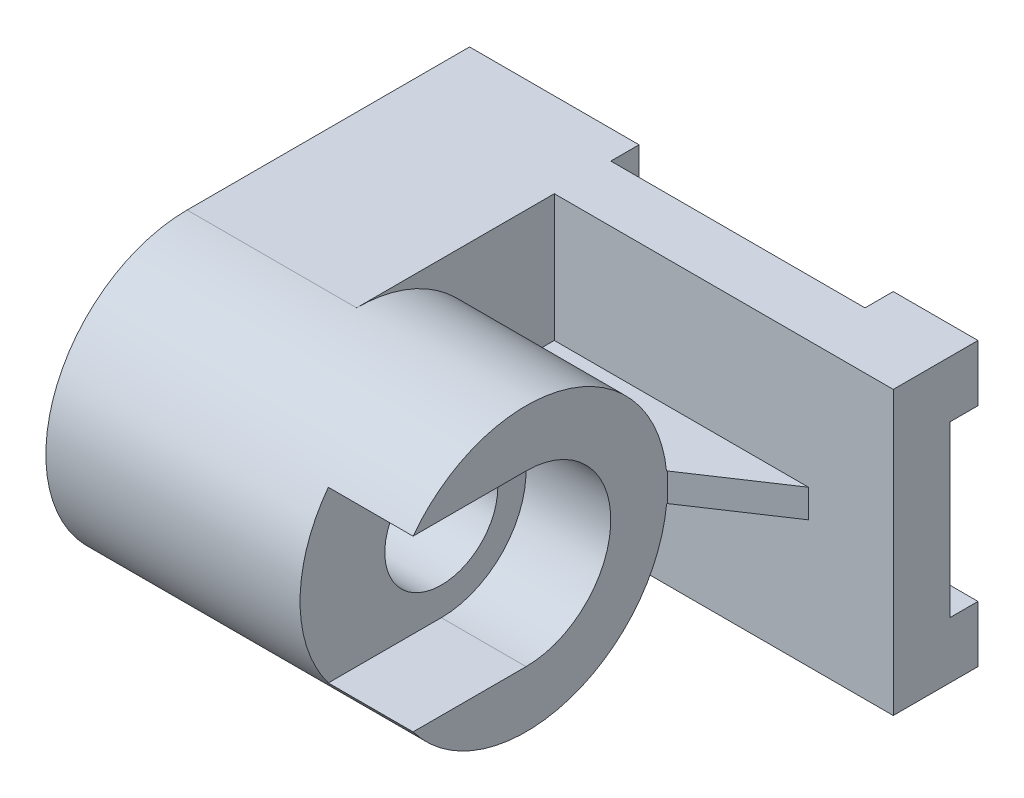
ISO-10303-21;
HEADER;
FILE_DESCRIPTION(('STEP AP214'),'2;1');
FILE_NAME('part.step','',(''),(''),'','','');
FILE_SCHEMA(('AUTOMOTIVE_DESIGN { 1 0 10303 214 1 1 1 1 }'));
ENDSEC;
DATA;
#1=APPLICATION_CONTEXT('core data for automotive mechanical design processes');
#2=APPLICATION_PROTOCOL_DEFINITION('international standard','automotive_design',2000,#1);
#3=PRODUCT_CONTEXT('',#1,'mechanical');
#4=PRODUCT('Part','Part','',(#3));
#5=PRODUCT_RELATED_PRODUCT_CATEGORY('part','',(#4));
#6=PRODUCT_DEFINITION_FORMATION('','',#4);
#7=PRODUCT_DEFINITION_CONTEXT('part definition',#1,'design');
#8=PRODUCT_DEFINITION('design','',#6,#7);
#9=PRODUCT_DEFINITION_SHAPE('','',#8);
#10=(LENGTH_UNIT() NAMED_UNIT(*) SI_UNIT(.MILLI.,.METRE.));
#11=(NAMED_UNIT(*) PLANE_ANGLE_UNIT() SI_UNIT($,.RADIAN.));
#12=(NAMED_UNIT(*) SI_UNIT($,.STERADIAN.) SOLID_ANGLE_UNIT());
#13=UNCERTAINTY_MEASURE_WITH_UNIT(LENGTH_MEASURE(1.E-05),#10,'distance_accuracy_value','');
#14=(GEOMETRIC_REPRESENTATION_CONTEXT(3) GLOBAL_UNCERTAINTY_ASSIGNED_CONTEXT((#13)) GLOBAL_UNIT_ASSIGNED_CONTEXT((#10,
#11,#12)) REPRESENTATION_CONTEXT('',''));
#15=CARTESIAN_POINT('',(0.,0.,0.));
#16=DIRECTION('',(0.,0.,1.));
#17=DIRECTION('',(1.,0.,0.));
#18=AXIS2_PLACEMENT_3D('',#15,#16,#17);
#19=CARTESIAN_POINT('',(18.,-5.,0.));
#20=DIRECTION('',(0.,-1.,0.));
#21=DIRECTION('',(0.,0.,-1.));
#22=AXIS2_PLACEMENT_3D('',#19,#20,#21);
#23=PLANE('',#22);
#24=DIRECTION('',(1.,0.,0.));
#25=VECTOR('',#24,1.);
#26=CARTESIAN_POINT('',(15.,-5.,-2.));
#27=LINE('',#26,#25);
#28=CARTESIAN_POINT('',(6.,-5.,-2.00000000000001));
#29=VERTEX_POINT('',#28);
#30=CARTESIAN_POINT('',(18.,-5.,-2.));
#31=VERTEX_POINT('',#30);
#32=EDGE_CURVE('E290',#29,#31,#27,.T.);
#33=ORIENTED_EDGE('',*,*,#32,.F.);
#34=DIRECTION('',(0.,0.,-1.));
#35=VECTOR('',#34,1.);
#36=CARTESIAN_POINT('',(6.,-5.,0.));
#37=LINE('',#36,#35);
#38=CARTESIAN_POINT('',(5.99999999999999,-5.,4.99999999999999));
#39=VERTEX_POINT('',#38);
#40=EDGE_CURVE('E249',#39,#29,#37,.T.);
#41=ORIENTED_EDGE('',*,*,#40,.F.);
#42=DIRECTION('',(-1.,0.,0.));
#43=VECTOR('',#42,1.);
#44=CARTESIAN_POINT('',(18.,-5.,5.));
#45=LINE('',#44,#43);
#46=CARTESIAN_POINT('',(0.,-5.,5.));
#47=VERTEX_POINT('',#46);
#48=EDGE_CURVE('E390',#39,#47,#45,.T.);
#49=ORIENTED_EDGE('',*,*,#48,.T.);
#50=DIRECTION('',(0.,0.,1.));
#51=VECTOR('',#50,1.);
#52=CARTESIAN_POINT('',(0.,-5.,0.));
#53=LINE('',#52,#51);
#54=CARTESIAN_POINT('',(0.,-5.,-5.));
#55=VERTEX_POINT('',#54);
#56=EDGE_CURVE('E348',#55,#47,#53,.T.);
#57=ORIENTED_EDGE('',*,*,#56,.F.);
#58=DIRECTION('',(-1.,0.,0.));
#59=VECTOR('',#58,1.);
#60=CARTESIAN_POINT('',(18.,-5.,-5.));
#61=LINE('',#60,#59);
#62=CARTESIAN_POINT('',(6.,-5.,-5.));
#63=VERTEX_POINT('',#62);
#64=EDGE_CURVE('E386',#63,#55,#61,.T.);
#65=ORIENTED_EDGE('',*,*,#64,.F.);
#66=DIRECTION('',(0.,0.,-1.));
#67=VECTOR('',#66,1.);
#68=CARTESIAN_POINT('',(6.,-5.,-5.));
#69=LINE('',#68,#67);
#70=CARTESIAN_POINT('',(6.,-5.,-4.));
#71=VERTEX_POINT('',#70);
#72=EDGE_CURVE('E301',#71,#63,#69,.T.);
#73=ORIENTED_EDGE('',*,*,#72,.F.);
#74=DIRECTION('',(-1.,0.,0.));
#75=VECTOR('',#74,1.);
#76=CARTESIAN_POINT('',(15.,-5.,-4.));
#77=LINE('',#76,#75);
#78=CARTESIAN_POINT('',(15.,-5.,-4.));
#79=VERTEX_POINT('',#78);
#80=EDGE_CURVE('E299',#79,#71,#77,.T.);
#81=ORIENTED_EDGE('',*,*,#80,.F.);
#82=DIRECTION('',(0.,0.,1.));
#83=VECTOR('',#82,1.);
#84=CARTESIAN_POINT('',(15.,-5.,-5.));
#85=LINE('',#84,#83);
#86=CARTESIAN_POINT('',(15.,-5.,-5.));
#87=VERTEX_POINT('',#86);
#88=EDGE_CURVE('E288',#87,#79,#85,.T.);
#89=ORIENTED_EDGE('',*,*,#88,.F.);
#90=CARTESIAN_POINT('',(18.,-5.,-5.));
#91=VERTEX_POINT('',#90);
#92=EDGE_CURVE('E387',#91,#87,#61,.T.);
#93=ORIENTED_EDGE('',*,*,#92,.F.);
#94=DIRECTION('',(0.,0.,1.));
#95=VECTOR('',#94,1.);
#96=CARTESIAN_POINT('',(18.,-5.,0.));
#97=LINE('',#96,#95);
#98=EDGE_CURVE('E326',#91,#31,#97,.T.);
#99=ORIENTED_EDGE('',*,*,#98,.T.);
#100=EDGE_LOOP('',(#33,#41,#49,#57,#65,#73,#81,#89,#93,#99));
#101=FACE_BOUND('',#100,.T.);
#102=ADVANCED_FACE('F35',(#101),#23,.T.);
#103=CARTESIAN_POINT('',(12.,13.,0.));
#104=DIRECTION('',(-0.554700196225229,0.,-0.832050294337843));
#105=DIRECTION('',(-0.832050294337844,0.,0.554700196225229));
#106=AXIS2_PLACEMENT_3D('',#103,#104,#105);
#107=PLANE('',#106);
#108=DIRECTION('',(0.832050294337844,0.,-0.554700196225229));
#109=VECTOR('',#108,1.);
#110=CARTESIAN_POINT('',(12.,0.500000000000002,0.));
#111=LINE('',#110,#109);
#112=CARTESIAN_POINT('',(12.,0.500000000000002,0.));
#113=VERTEX_POINT('',#112);
#114=CARTESIAN_POINT('',(15.,0.500000000000002,-2.));
#115=VERTEX_POINT('',#114);
#116=EDGE_CURVE('E264',#113,#115,#111,.T.);
#117=ORIENTED_EDGE('',*,*,#116,.F.);
#118=DIRECTION('',(0.,-1.,0.));
#119=VECTOR('',#118,1.);
#120=CARTESIAN_POINT('',(12.,13.,0.));
#121=LINE('',#120,#119);
#122=CARTESIAN_POINT('',(12.,-0.499999999999998,0.));
#123=VERTEX_POINT('',#122);
#124=EDGE_CURVE('E292',#113,#123,#121,.T.);
#125=ORIENTED_EDGE('',*,*,#124,.T.);
#126=DIRECTION('',(-0.832050294337844,0.,0.554700196225229));
#127=VECTOR('',#126,1.);
#128=CARTESIAN_POINT('',(12.,-0.499999999999999,0.));
#129=LINE('',#128,#127);
#130=CARTESIAN_POINT('',(15.,-0.499999999999998,-2.));
#131=VERTEX_POINT('',#130);
#132=EDGE_CURVE('E262',#131,#123,#129,.T.);
#133=ORIENTED_EDGE('',*,*,#132,.F.);
#134=DIRECTION('',(0.,-1.,0.));
#135=VECTOR('',#134,1.);
#136=CARTESIAN_POINT('',(15.,13.,-2.));
#137=LINE('',#136,#135);
#138=EDGE_CURVE('E223',#115,#131,#137,.T.);
#139=ORIENTED_EDGE('',*,*,#138,.F.);
#140=EDGE_LOOP('',(#117,#125,#133,#139));
#141=FACE_BOUND('',#140,.T.);
#142=ADVANCED_FACE('F430',(#141),#107,.F.);
#143=CARTESIAN_POINT('',(12.,13.,9.00000000000001));
#144=DIRECTION('',(-1.,0.,0.));
#145=DIRECTION('',(0.,0.,1.));
#146=AXIS2_PLACEMENT_3D('',#143,#144,#145);
#147=PLANE('',#146);
#148=DIRECTION('',(0.,0.,-1.));
#149=VECTOR('',#148,1.);
#150=CARTESIAN_POINT('',(12.,0.5,9.));
#151=LINE('',#150,#149);
#152=CARTESIAN_POINT('',(12.,0.500000000000002,0.0250628144669021));
#153=VERTEX_POINT('',#152);
#154=EDGE_CURVE('E11',#153,#113,#151,.T.);
#155=ORIENTED_EDGE('',*,*,#154,.F.);
#156=CARTESIAN_POINT('',(12.,0.,5.));
#157=DIRECTION('',(-1.,0.,0.));
#158=DIRECTION('',(0.,0.,1.));
#159=AXIS2_PLACEMENT_3D('',#156,#157,#158);
#160=CIRCLE('',#159,5.);
#161=CARTESIAN_POINT('',(12.,3.,9.));
#162=VERTEX_POINT('',#161);
#163=EDGE_CURVE('E323',#162,#153,#160,.T.);
#164=ORIENTED_EDGE('',*,*,#163,.F.);
#165=DIRECTION('',(0.,0.,1.));
#166=VECTOR('',#165,1.);
#167=CARTESIAN_POINT('',(12.,3.,0.));
#168=LINE('',#167,#166);
#169=CARTESIAN_POINT('',(12.,3.,5.));
#170=VERTEX_POINT('',#169);
#171=EDGE_CURVE('E266',#170,#162,#168,.T.);
#172=ORIENTED_EDGE('',*,*,#171,.F.);
#173=CARTESIAN_POINT('',(12.,0.,5.));
#174=DIRECTION('',(1.,0.,0.));
#175=DIRECTION('',(0.,0.,-1.));
#176=AXIS2_PLACEMENT_3D('',#173,#174,#175);
#177=CIRCLE('',#176,3.);
#178=CARTESIAN_POINT('',(12.,-3.,5.));
#179=VERTEX_POINT('',#178);
#180=EDGE_CURVE('E271',#179,#170,#177,.T.);
#181=ORIENTED_EDGE('',*,*,#180,.F.);
#182=DIRECTION('',(0.,0.,1.));
#183=VECTOR('',#182,1.);
#184=CARTESIAN_POINT('',(12.,-3.,0.));
#185=LINE('',#184,#183);
#186=CARTESIAN_POINT('',(12.,-3.,9.));
#187=VERTEX_POINT('',#186);
#188=EDGE_CURVE('E281',#179,#187,#185,.T.);
#189=ORIENTED_EDGE('',*,*,#188,.T.);
#190=CARTESIAN_POINT('',(12.,-0.499999999999998,0.0250628144669021));
#191=VERTEX_POINT('',#190);
#192=EDGE_CURVE('E325',#191,#187,#160,.T.);
#193=ORIENTED_EDGE('',*,*,#192,.F.);
#194=DIRECTION('',(0.,0.,1.));
#195=VECTOR('',#194,1.);
#196=CARTESIAN_POINT('',(12.,-0.5,9.));
#197=LINE('',#196,#195);
#198=EDGE_CURVE('E43',#123,#191,#197,.T.);
#199=ORIENTED_EDGE('',*,*,#198,.F.);
#200=ORIENTED_EDGE('',*,*,#124,.F.);
#201=EDGE_LOOP('',(#155,#164,#172,#181,#189,#193,#199,#200));
#202=FACE_BOUND('',#201,.T.);
#203=ADVANCED_FACE('F432',(#202),#147,.F.);
#204=CARTESIAN_POINT('',(18.,0.,5.));
#205=DIRECTION('',(-1.,0.,0.));
#206=DIRECTION('',(0.,0.,1.));
#207=AXIS2_PLACEMENT_3D('',#204,#205,#206);
#208=CYLINDRICAL_SURFACE('',#207,2.);
#209=CARTESIAN_POINT('',(0.,0.,5.));
#210=DIRECTION('',(1.,0.,0.));
#211=DIRECTION('',(0.,0.,-1.));
#212=AXIS2_PLACEMENT_3D('',#209,#210,#211);
#213=CIRCLE('',#212,2.);
#214=CARTESIAN_POINT('',(0.,0.,3.));
#215=VERTEX_POINT('',#214);
#216=EDGE_CURVE('E342',#215,#215,#213,.T.);
#217=ORIENTED_EDGE('',*,*,#216,.F.);
#218=EDGE_LOOP('',(#217));
#219=FACE_BOUND('',#218,.T.);
#220=CARTESIAN_POINT('',(9.,0.,5.));
#221=DIRECTION('',(1.,0.,0.));
#222=DIRECTION('',(0.,0.,-1.));
#223=AXIS2_PLACEMENT_3D('',#220,#221,#222);
#224=CIRCLE('',#223,2.);
#225=CARTESIAN_POINT('',(9.,0.,3.));
#226=VERTEX_POINT('',#225);
#227=EDGE_CURVE('E276',#226,#226,#224,.F.);
#228=ORIENTED_EDGE('',*,*,#227,.F.);
#229=EDGE_LOOP('',(#228));
#230=FACE_BOUND('',#229,.T.);
#231=ADVANCED_FACE('F37',(#219,#230),#208,.F.);
#232=CARTESIAN_POINT('',(18.,0.,-5.));
#233=DIRECTION('',(0.,0.,1.));
#234=DIRECTION('',(1.,0.,0.));
#235=AXIS2_PLACEMENT_3D('',#232,#233,#234);
#236=PLANE('',#235);
#237=ORIENTED_EDGE('',*,*,#92,.T.);
#238=DIRECTION('',(0.,-1.,0.));
#239=VECTOR('',#238,1.);
#240=CARTESIAN_POINT('',(15.,13.,-5.));
#241=LINE('',#240,#239);
#242=CARTESIAN_POINT('',(15.,-3.,-5.));
#243=VERTEX_POINT('',#242);
#244=EDGE_CURVE('E304',#243,#87,#241,.T.);
#245=ORIENTED_EDGE('',*,*,#244,.F.);
#246=DIRECTION('',(-1.,0.,0.));
#247=VECTOR('',#246,1.);
#248=CARTESIAN_POINT('',(18.,-3.,-5.));
#249=LINE('',#248,#247);
#250=CARTESIAN_POINT('',(18.,-3.,-5.));
#251=VERTEX_POINT('',#250);
#252=EDGE_CURVE('E383',#251,#243,#249,.T.);
#253=ORIENTED_EDGE('',*,*,#252,.F.);
#254=DIRECTION('',(0.,1.,0.));
#255=VECTOR('',#254,1.);
#256=CARTESIAN_POINT('',(18.,0.,-5.));
#257=LINE('',#256,#255);
#258=EDGE_CURVE('E329',#91,#251,#257,.T.);
#259=ORIENTED_EDGE('',*,*,#258,.F.);
#260=EDGE_LOOP('',(#237,#245,#253,#259));
#261=FACE_BOUND('',#260,.T.);
#262=ADVANCED_FACE('F484',(#261),#236,.F.);
#263=CARTESIAN_POINT('',(18.,-3.,0.));
#264=DIRECTION('',(0.,-1.,0.));
#265=DIRECTION('',(0.,0.,-1.));
#266=AXIS2_PLACEMENT_3D('',#263,#264,#265);
#267=PLANE('',#266);
#268=ORIENTED_EDGE('',*,*,#252,.T.);
#269=DIRECTION('',(0.,0.,1.));
#270=VECTOR('',#269,1.);
#271=CARTESIAN_POINT('',(15.,-3.,0.));
#272=LINE('',#271,#270);
#273=CARTESIAN_POINT('',(15.,-3.,-4.));
#274=VERTEX_POINT('',#273);
#275=EDGE_CURVE('E320',#243,#274,#272,.T.);
#276=ORIENTED_EDGE('',*,*,#275,.T.);
#277=DIRECTION('',(-1.,0.,0.));
#278=VECTOR('',#277,1.);
#279=CARTESIAN_POINT('',(18.,-3.,-4.));
#280=LINE('',#279,#278);
#281=CARTESIAN_POINT('',(18.,-3.,-4.));
#282=VERTEX_POINT('',#281);
#283=EDGE_CURVE('E379',#282,#274,#280,.T.);
#284=ORIENTED_EDGE('',*,*,#283,.F.);
#285=DIRECTION('',(0.,0.,1.));
#286=VECTOR('',#285,1.);
#287=CARTESIAN_POINT('',(18.,-3.,0.));
#288=LINE('',#287,#286);
#289=EDGE_CURVE('E332',#251,#282,#288,.T.);
#290=ORIENTED_EDGE('',*,*,#289,.F.);
#291=EDGE_LOOP('',(#268,#276,#284,#290));
#292=FACE_BOUND('',#291,.T.);
#293=ADVANCED_FACE('F488',(#292),#267,.F.);
#294=CARTESIAN_POINT('',(18.,3.,0.));
#295=DIRECTION('',(0.,-1.,0.));
#296=DIRECTION('',(0.,0.,-1.));
#297=AXIS2_PLACEMENT_3D('',#294,#295,#296);
#298=PLANE('',#297);
#299=DIRECTION('',(0.,0.,1.));
#300=VECTOR('',#299,1.);
#301=CARTESIAN_POINT('',(15.,3.,0.));
#302=LINE('',#301,#300);
#303=CARTESIAN_POINT('',(15.,3.,-5.));
#304=VERTEX_POINT('',#303);
#305=CARTESIAN_POINT('',(15.,3.,-4.));
#306=VERTEX_POINT('',#305);
#307=EDGE_CURVE('E318',#304,#306,#302,.T.);
#308=ORIENTED_EDGE('',*,*,#307,.F.);
#309=DIRECTION('',(-1.,0.,0.));
#310=VECTOR('',#309,1.);
#311=CARTESIAN_POINT('',(18.,3.,-5.));
#312=LINE('',#311,#310);
#313=CARTESIAN_POINT('',(18.,3.,-5.));
#314=VERTEX_POINT('',#313);
#315=EDGE_CURVE('E371',#314,#304,#312,.T.);
#316=ORIENTED_EDGE('',*,*,#315,.F.);
#317=DIRECTION('',(0.,0.,1.));
#318=VECTOR('',#317,1.);
#319=CARTESIAN_POINT('',(18.,3.,0.));
#320=LINE('',#319,#318);
#321=CARTESIAN_POINT('',(18.,3.,-4.));
#322=VERTEX_POINT('',#321);
#323=EDGE_CURVE('E337',#314,#322,#320,.T.);
#324=ORIENTED_EDGE('',*,*,#323,.T.);
#325=DIRECTION('',(-1.,0.,0.));
#326=VECTOR('',#325,1.);
#327=CARTESIAN_POINT('',(18.,3.,-4.));
#328=LINE('',#327,#326);
#329=EDGE_CURVE('E375',#322,#306,#328,.T.);
#330=ORIENTED_EDGE('',*,*,#329,.T.);
#331=EDGE_LOOP('',(#308,#316,#324,#330));
#332=FACE_BOUND('',#331,.T.);
#333=ADVANCED_FACE('F482',(#332),#298,.T.);
#334=ORIENTED_EDGE('',*,*,#315,.T.);
#335=CARTESIAN_POINT('',(15.,5.,-5.));
#336=VERTEX_POINT('',#335);
#337=EDGE_CURVE('E293',#336,#304,#241,.T.);
#338=ORIENTED_EDGE('',*,*,#337,.F.);
#339=DIRECTION('',(-1.,0.,0.));
#340=VECTOR('',#339,1.);
#341=CARTESIAN_POINT('',(18.,5.,-5.));
#342=LINE('',#341,#340);
#343=CARTESIAN_POINT('',(18.,5.,-5.));
#344=VERTEX_POINT('',#343);
#345=EDGE_CURVE('E367',#344,#336,#342,.T.);
#346=ORIENTED_EDGE('',*,*,#345,.F.);
#347=EDGE_CURVE('E333',#314,#344,#257,.T.);
#348=ORIENTED_EDGE('',*,*,#347,.F.);
#349=EDGE_LOOP('',(#334,#338,#346,#348));
#350=FACE_BOUND('',#349,.T.);
#351=ADVANCED_FACE('F474',(#350),#236,.F.);
#352=CARTESIAN_POINT('',(18.,0.,5.));
#353=DIRECTION('',(-1.,0.,0.));
#354=DIRECTION('',(0.,0.,1.));
#355=AXIS2_PLACEMENT_3D('',#352,#353,#354);
#356=CYLINDRICAL_SURFACE('',#355,5.);
#357=DIRECTION('',(-1.,0.,0.));
#358=VECTOR('',#357,1.);
#359=CARTESIAN_POINT('',(18.,3.,9.));
#360=LINE('',#359,#358);
#361=CARTESIAN_POINT('',(8.99999999999999,3.,9.));
#362=VERTEX_POINT('',#361);
#363=EDGE_CURVE('E405',#362,#162,#360,.F.);
#364=ORIENTED_EDGE('',*,*,#363,.T.);
#365=ORIENTED_EDGE('',*,*,#163,.T.);
#366=DIRECTION('',(1.,0.,0.));
#367=VECTOR('',#366,1.);
#368=CARTESIAN_POINT('',(6.,0.500000000000002,0.0250628144668951));
#369=LINE('',#368,#367);
#370=CARTESIAN_POINT('',(6.,0.500000000000002,0.0250628144668951));
#371=VERTEX_POINT('',#370);
#372=EDGE_CURVE('E242',#371,#153,#369,.T.);
#373=ORIENTED_EDGE('',*,*,#372,.F.);
#374=CARTESIAN_POINT('',(5.99999999999999,0.,4.99999999999999));
#375=DIRECTION('',(1.,0.,0.));
#376=DIRECTION('',(0.,0.,-1.));
#377=AXIS2_PLACEMENT_3D('',#374,#375,#376);
#378=CIRCLE('',#377,5.);
#379=CARTESIAN_POINT('',(5.99999999999999,5.,4.99999999999999));
#380=VERTEX_POINT('',#379);
#381=EDGE_CURVE('E237',#371,#380,#378,.T.);
#382=ORIENTED_EDGE('',*,*,#381,.T.);
#383=DIRECTION('',(-1.,0.,0.));
#384=VECTOR('',#383,1.);
#385=CARTESIAN_POINT('',(18.,5.,5.));
#386=LINE('',#385,#384);
#387=CARTESIAN_POINT('',(0.,5.,5.));
#388=VERTEX_POINT('',#387);
#389=EDGE_CURVE('E236',#380,#388,#386,.T.);
#390=ORIENTED_EDGE('',*,*,#389,.T.);
#391=CARTESIAN_POINT('',(0.,0.,5.));
#392=DIRECTION('',(1.,0.,0.));
#393=DIRECTION('',(0.,0.,-1.));
#394=AXIS2_PLACEMENT_3D('',#391,#392,#393);
#395=CIRCLE('',#394,5.);
#396=EDGE_CURVE('E345',#388,#47,#395,.T.);
#397=ORIENTED_EDGE('',*,*,#396,.T.);
#398=ORIENTED_EDGE('',*,*,#48,.F.);
#399=CARTESIAN_POINT('',(5.99999999999999,0.,4.99999999999999));
#400=DIRECTION('',(1.,0.,0.));
#401=DIRECTION('',(0.,0.,-1.));
#402=AXIS2_PLACEMENT_3D('',#399,#400,#401);
#403=CIRCLE('',#402,5.);
#404=CARTESIAN_POINT('',(6.,-0.499999999999998,0.0250628144668951));
#405=VERTEX_POINT('',#404);
#406=EDGE_CURVE('E244',#39,#405,#403,.T.);
#407=ORIENTED_EDGE('',*,*,#406,.T.);
#408=DIRECTION('',(-1.,0.,0.));
#409=VECTOR('',#408,1.);
#410=CARTESIAN_POINT('',(15.,-0.499999999999998,0.0250628144669056));
#411=LINE('',#410,#409);
#412=EDGE_CURVE('E258',#191,#405,#411,.T.);
#413=ORIENTED_EDGE('',*,*,#412,.F.);
#414=ORIENTED_EDGE('',*,*,#192,.T.);
#415=DIRECTION('',(-1.,0.,0.));
#416=VECTOR('',#415,1.);
#417=CARTESIAN_POINT('',(18.,-3.,9.));
#418=LINE('',#417,#416);
#419=CARTESIAN_POINT('',(8.99999999999999,-3.,9.));
#420=VERTEX_POINT('',#419);
#421=EDGE_CURVE('E408',#187,#420,#418,.T.);
#422=ORIENTED_EDGE('',*,*,#421,.T.);
#423=CARTESIAN_POINT('',(8.99999999999999,0.,5.));
#424=DIRECTION('',(-1.,0.,0.));
#425=DIRECTION('',(0.,0.,1.));
#426=AXIS2_PLACEMENT_3D('',#423,#424,#425);
#427=CIRCLE('',#426,5.);
#428=EDGE_CURVE('E402',#420,#362,#427,.T.);
#429=ORIENTED_EDGE('',*,*,#428,.T.);
#430=EDGE_LOOP('',(#364,#365,#373,#382,#390,#397,#398,#407,#413,#414,#422,#429));
#431=FACE_BOUND('',#430,.T.);
#432=ADVANCED_FACE('F421',(#431),#356,.T.);
#433=CARTESIAN_POINT('',(6.,-3.,-5.));
#434=VERTEX_POINT('',#433);
#435=CARTESIAN_POINT('',(0.,-3.,-5.));
#436=VERTEX_POINT('',#435);
#437=EDGE_CURVE('E382',#434,#436,#249,.T.);
#438=ORIENTED_EDGE('',*,*,#437,.F.);
#439=DIRECTION('',(0.,-1.,0.));
#440=VECTOR('',#439,1.);
#441=CARTESIAN_POINT('',(6.,13.,-5.));
#442=LINE('',#441,#440);
#443=EDGE_CURVE('E307',#434,#63,#442,.T.);
#444=ORIENTED_EDGE('',*,*,#443,.T.);
#445=ORIENTED_EDGE('',*,*,#64,.T.);
#446=DIRECTION('',(0.,1.,0.));
#447=VECTOR('',#446,1.);
#448=CARTESIAN_POINT('',(0.,0.,-5.));
#449=LINE('',#448,#447);
#450=EDGE_CURVE('E351',#55,#436,#449,.T.);
#451=ORIENTED_EDGE('',*,*,#450,.T.);
#452=EDGE_LOOP('',(#438,#444,#445,#451));
#453=FACE_BOUND('',#452,.T.);
#454=ADVANCED_FACE('F473',(#453),#236,.F.);
#455=CARTESIAN_POINT('',(6.,-3.,-4.));
#456=VERTEX_POINT('',#455);
#457=CARTESIAN_POINT('',(0.,-3.,-4.));
#458=VERTEX_POINT('',#457);
#459=EDGE_CURVE('E378',#456,#458,#280,.T.);
#460=ORIENTED_EDGE('',*,*,#459,.F.);
#461=DIRECTION('',(0.,0.,-1.));
#462=VECTOR('',#461,1.);
#463=CARTESIAN_POINT('',(6.,-3.,0.));
#464=LINE('',#463,#462);
#465=EDGE_CURVE('E315',#456,#434,#464,.T.);
#466=ORIENTED_EDGE('',*,*,#465,.T.);
#467=ORIENTED_EDGE('',*,*,#437,.T.);
#468=DIRECTION('',(0.,0.,1.));
#469=VECTOR('',#468,1.);
#470=CARTESIAN_POINT('',(0.,-3.,0.));
#471=LINE('',#470,#469);
#472=EDGE_CURVE('E354',#436,#458,#471,.T.);
#473=ORIENTED_EDGE('',*,*,#472,.T.);
#474=EDGE_LOOP('',(#460,#466,#467,#473));
#475=FACE_BOUND('',#474,.T.);
#476=ADVANCED_FACE('F470',(#475),#267,.F.);
#477=CARTESIAN_POINT('',(18.,0.,-4.));
#478=DIRECTION('',(0.,0.,1.));
#479=DIRECTION('',(1.,0.,0.));
#480=AXIS2_PLACEMENT_3D('',#477,#478,#479);
#481=PLANE('',#480);
#482=CARTESIAN_POINT('',(6.,3.,-4.));
#483=VERTEX_POINT('',#482);
#484=CARTESIAN_POINT('',(0.,3.,-4.));
#485=VERTEX_POINT('',#484);
#486=EDGE_CURVE('E374',#483,#485,#328,.T.);
#487=ORIENTED_EDGE('',*,*,#486,.F.);
#488=DIRECTION('',(0.,-1.,0.));
#489=VECTOR('',#488,1.);
#490=CARTESIAN_POINT('',(6.,13.,-4.));
#491=LINE('',#490,#489);
#492=CARTESIAN_POINT('',(6.,5.,-4.));
#493=VERTEX_POINT('',#492);
#494=EDGE_CURVE('E310',#493,#483,#491,.T.);
#495=ORIENTED_EDGE('',*,*,#494,.F.);
#496=DIRECTION('',(-1.,0.,0.));
#497=VECTOR('',#496,1.);
#498=CARTESIAN_POINT('',(18.,5.,-4.));
#499=LINE('',#498,#497);
#500=CARTESIAN_POINT('',(15.,5.,-4.));
#501=VERTEX_POINT('',#500);
#502=EDGE_CURVE('E393',#501,#493,#499,.T.);
#503=ORIENTED_EDGE('',*,*,#502,.F.);
#504=DIRECTION('',(0.,-1.,0.));
#505=VECTOR('',#504,1.);
#506=CARTESIAN_POINT('',(15.,13.,-4.));
#507=LINE('',#506,#505);
#508=EDGE_CURVE('E312',#501,#306,#507,.T.);
#509=ORIENTED_EDGE('',*,*,#508,.T.);
#510=ORIENTED_EDGE('',*,*,#329,.F.);
#511=DIRECTION('',(0.,1.,0.));
#512=VECTOR('',#511,1.);
#513=CARTESIAN_POINT('',(18.,0.,-4.));
#514=LINE('',#513,#512);
#515=EDGE_CURVE('E335',#282,#322,#514,.T.);
#516=ORIENTED_EDGE('',*,*,#515,.F.);
#517=ORIENTED_EDGE('',*,*,#283,.T.);
#518=EDGE_CURVE('E303',#274,#79,#507,.T.);
#519=ORIENTED_EDGE('',*,*,#518,.T.);
#520=ORIENTED_EDGE('',*,*,#80,.T.);
#521=EDGE_CURVE('E58',#456,#71,#491,.T.);
#522=ORIENTED_EDGE('',*,*,#521,.F.);
#523=ORIENTED_EDGE('',*,*,#459,.T.);
#524=DIRECTION('',(0.,1.,0.));
#525=VECTOR('',#524,1.);
#526=CARTESIAN_POINT('',(0.,0.,-4.));
#527=LINE('',#526,#525);
#528=EDGE_CURVE('E358',#458,#485,#527,.T.);
#529=ORIENTED_EDGE('',*,*,#528,.T.);
#530=EDGE_LOOP('',(#487,#495,#503,#509,#510,#516,#517,#519,#520,#522,#523,#529));
#531=FACE_BOUND('',#530,.T.);
#532=ADVANCED_FACE('F508',(#531),#481,.F.);
#533=DIRECTION('',(0.,0.,-1.));
#534=VECTOR('',#533,1.);
#535=CARTESIAN_POINT('',(6.,3.,0.));
#536=LINE('',#535,#534);
#537=CARTESIAN_POINT('',(6.,3.,-5.));
#538=VERTEX_POINT('',#537);
#539=EDGE_CURVE('E222',#483,#538,#536,.T.);
#540=ORIENTED_EDGE('',*,*,#539,.F.);
#541=ORIENTED_EDGE('',*,*,#486,.T.);
#542=DIRECTION('',(0.,0.,1.));
#543=VECTOR('',#542,1.);
#544=CARTESIAN_POINT('',(0.,3.,0.));
#545=LINE('',#544,#543);
#546=CARTESIAN_POINT('',(0.,3.,-5.));
#547=VERTEX_POINT('',#546);
#548=EDGE_CURVE('E361',#547,#485,#545,.T.);
#549=ORIENTED_EDGE('',*,*,#548,.F.);
#550=EDGE_CURVE('E370',#538,#547,#312,.T.);
#551=ORIENTED_EDGE('',*,*,#550,.F.);
#552=EDGE_LOOP('',(#540,#541,#549,#551));
#553=FACE_BOUND('',#552,.T.);
#554=ADVANCED_FACE('F491',(#553),#298,.T.);
#555=CARTESIAN_POINT('',(6.,5.,-5.));
#556=VERTEX_POINT('',#555);
#557=CARTESIAN_POINT('',(0.,5.,-5.));
#558=VERTEX_POINT('',#557);
#559=EDGE_CURVE('E366',#556,#558,#342,.T.);
#560=ORIENTED_EDGE('',*,*,#559,.F.);
#561=EDGE_CURVE('E306',#556,#538,#442,.T.);
#562=ORIENTED_EDGE('',*,*,#561,.T.);
#563=ORIENTED_EDGE('',*,*,#550,.T.);
#564=EDGE_CURVE('E355',#547,#558,#449,.T.);
#565=ORIENTED_EDGE('',*,*,#564,.T.);
#566=EDGE_LOOP('',(#560,#562,#563,#565));
#567=FACE_BOUND('',#566,.T.);
#568=ADVANCED_FACE('F481',(#567),#236,.F.);
#569=CARTESIAN_POINT('',(18.,5.,0.));
#570=DIRECTION('',(0.,-1.,0.));
#571=DIRECTION('',(0.,0.,-1.));
#572=AXIS2_PLACEMENT_3D('',#569,#570,#571);
#573=PLANE('',#572);
#574=DIRECTION('',(0.,0.,1.));
#575=VECTOR('',#574,1.);
#576=CARTESIAN_POINT('',(6.,5.,0.));
#577=LINE('',#576,#575);
#578=CARTESIAN_POINT('',(6.,5.,-2.00000000000001));
#579=VERTEX_POINT('',#578);
#580=EDGE_CURVE('E230',#579,#380,#577,.T.);
#581=ORIENTED_EDGE('',*,*,#580,.F.);
#582=DIRECTION('',(1.,0.,0.));
#583=VECTOR('',#582,1.);
#584=CARTESIAN_POINT('',(18.,5.,-2.));
#585=LINE('',#584,#583);
#586=CARTESIAN_POINT('',(18.,5.,-2.));
#587=VERTEX_POINT('',#586);
#588=EDGE_CURVE('E212',#579,#587,#585,.T.);
#589=ORIENTED_EDGE('',*,*,#588,.T.);
#590=DIRECTION('',(0.,0.,1.));
#591=VECTOR('',#590,1.);
#592=CARTESIAN_POINT('',(18.,5.,0.));
#593=LINE('',#592,#591);
#594=EDGE_CURVE('E340',#344,#587,#593,.T.);
#595=ORIENTED_EDGE('',*,*,#594,.F.);
#596=ORIENTED_EDGE('',*,*,#345,.T.);
#597=DIRECTION('',(0.,0.,1.));
#598=VECTOR('',#597,1.);
#599=CARTESIAN_POINT('',(15.,5.,0.));
#600=LINE('',#599,#598);
#601=EDGE_CURVE('E399',#336,#501,#600,.T.);
#602=ORIENTED_EDGE('',*,*,#601,.T.);
#603=ORIENTED_EDGE('',*,*,#502,.T.);
#604=DIRECTION('',(0.,0.,-1.));
#605=VECTOR('',#604,1.);
#606=CARTESIAN_POINT('',(6.,5.,0.));
#607=LINE('',#606,#605);
#608=EDGE_CURVE('E396',#493,#556,#607,.T.);
#609=ORIENTED_EDGE('',*,*,#608,.T.);
#610=ORIENTED_EDGE('',*,*,#559,.T.);
#611=DIRECTION('',(0.,0.,1.));
#612=VECTOR('',#611,1.);
#613=CARTESIAN_POINT('',(0.,5.,0.));
#614=LINE('',#613,#612);
#615=EDGE_CURVE('E330',#558,#388,#614,.T.);
#616=ORIENTED_EDGE('',*,*,#615,.T.);
#617=ORIENTED_EDGE('',*,*,#389,.F.);
#618=EDGE_LOOP('',(#581,#589,#595,#596,#602,#603,#609,#610,#616,#617));
#619=FACE_BOUND('',#618,.T.);
#620=ADVANCED_FACE('F234',(#619),#573,.F.);
#621=CARTESIAN_POINT('',(18.,0.,0.));
#622=DIRECTION('',(1.,0.,0.));
#623=DIRECTION('',(0.,0.,-1.));
#624=AXIS2_PLACEMENT_3D('',#621,#622,#623);
#625=PLANE('',#624);
#626=DIRECTION('',(0.,1.,0.));
#627=VECTOR('',#626,1.);
#628=CARTESIAN_POINT('',(18.,0.,-2.));
#629=LINE('',#628,#627);
#630=EDGE_CURVE('E217',#31,#587,#629,.T.);
#631=ORIENTED_EDGE('',*,*,#630,.F.);
#632=ORIENTED_EDGE('',*,*,#98,.F.);
#633=ORIENTED_EDGE('',*,*,#258,.T.);
#634=ORIENTED_EDGE('',*,*,#289,.T.);
#635=ORIENTED_EDGE('',*,*,#515,.T.);
#636=ORIENTED_EDGE('',*,*,#323,.F.);
#637=ORIENTED_EDGE('',*,*,#347,.T.);
#638=ORIENTED_EDGE('',*,*,#594,.T.);
#639=EDGE_LOOP('',(#631,#632,#633,#634,#635,#636,#637,#638));
#640=FACE_BOUND('',#639,.T.);
#641=ADVANCED_FACE('F507',(#640),#625,.T.);
#642=CARTESIAN_POINT('',(0.,0.,0.));
#643=DIRECTION('',(1.,0.,0.));
#644=DIRECTION('',(0.,0.,-1.));
#645=AXIS2_PLACEMENT_3D('',#642,#643,#644);
#646=PLANE('',#645);
#647=ORIENTED_EDGE('',*,*,#216,.T.);
#648=EDGE_LOOP('',(#647));
#649=FACE_BOUND('',#648,.T.);
#650=ORIENTED_EDGE('',*,*,#396,.F.);
#651=ORIENTED_EDGE('',*,*,#615,.F.);
#652=ORIENTED_EDGE('',*,*,#564,.F.);
#653=ORIENTED_EDGE('',*,*,#548,.T.);
#654=ORIENTED_EDGE('',*,*,#528,.F.);
#655=ORIENTED_EDGE('',*,*,#472,.F.);
#656=ORIENTED_EDGE('',*,*,#450,.F.);
#657=ORIENTED_EDGE('',*,*,#56,.T.);
#658=EDGE_LOOP('',(#650,#651,#652,#653,#654,#655,#656,#657));
#659=FACE_BOUND('',#658,.T.);
#660=ADVANCED_FACE('F527',(#649,#659),#646,.F.);
#661=CARTESIAN_POINT('',(8.99999999999999,13.,10.));
#662=DIRECTION('',(-1.,0.,0.));
#663=DIRECTION('',(0.,0.,1.));
#664=AXIS2_PLACEMENT_3D('',#661,#662,#663);
#665=PLANE('',#664);
#666=ORIENTED_EDGE('',*,*,#428,.F.);
#667=DIRECTION('',(0.,0.,1.));
#668=VECTOR('',#667,1.);
#669=CARTESIAN_POINT('',(9.,-3.,0.));
#670=LINE('',#669,#668);
#671=CARTESIAN_POINT('',(9.,-3.,5.));
#672=VERTEX_POINT('',#671);
#673=EDGE_CURVE('E270',#672,#420,#670,.T.);
#674=ORIENTED_EDGE('',*,*,#673,.F.);
#675=CARTESIAN_POINT('',(9.,0.,5.));
#676=DIRECTION('',(1.,0.,0.));
#677=DIRECTION('',(0.,0.,-1.));
#678=AXIS2_PLACEMENT_3D('',#675,#676,#677);
#679=CIRCLE('',#678,3.);
#680=CARTESIAN_POINT('',(9.,3.,5.));
#681=VERTEX_POINT('',#680);
#682=EDGE_CURVE('E273',#672,#681,#679,.T.);
#683=ORIENTED_EDGE('',*,*,#682,.T.);
#684=DIRECTION('',(0.,0.,1.));
#685=VECTOR('',#684,1.);
#686=CARTESIAN_POINT('',(9.,3.,0.));
#687=LINE('',#686,#685);
#688=EDGE_CURVE('E267',#681,#362,#687,.T.);
#689=ORIENTED_EDGE('',*,*,#688,.T.);
#690=EDGE_LOOP('',(#666,#674,#683,#689));
#691=FACE_BOUND('',#690,.T.);
#692=ORIENTED_EDGE('',*,*,#227,.T.);
#693=EDGE_LOOP('',(#692));
#694=FACE_BOUND('',#693,.T.);
#695=ADVANCED_FACE('F443',(#691,#694),#665,.F.);
#696=CARTESIAN_POINT('',(15.,13.,-2.));
#697=DIRECTION('',(0.,0.,-1.));
#698=DIRECTION('',(0.,1.,0.));
#699=AXIS2_PLACEMENT_3D('',#696,#697,#698);
#700=PLANE('',#699);
#701=ORIENTED_EDGE('',*,*,#588,.F.);
#702=DIRECTION('',(0.,1.,0.));
#703=VECTOR('',#702,1.);
#704=CARTESIAN_POINT('',(6.,0.,-2.00000000000001));
#705=LINE('',#704,#703);
#706=CARTESIAN_POINT('',(6.,0.500000000000002,-2.00000000000001));
#707=VERTEX_POINT('',#706);
#708=EDGE_CURVE('E215',#707,#579,#705,.T.);
#709=ORIENTED_EDGE('',*,*,#708,.F.);
#710=DIRECTION('',(1.,0.,0.));
#711=VECTOR('',#710,1.);
#712=CARTESIAN_POINT('',(6.,0.500000000000002,-2.00000000000001));
#713=LINE('',#712,#711);
#714=EDGE_CURVE('E50',#707,#115,#713,.T.);
#715=ORIENTED_EDGE('',*,*,#714,.T.);
#716=ORIENTED_EDGE('',*,*,#138,.T.);
#717=DIRECTION('',(-1.,0.,0.));
#718=VECTOR('',#717,1.);
#719=CARTESIAN_POINT('',(15.,-0.499999999999998,-2.));
#720=LINE('',#719,#718);
#721=CARTESIAN_POINT('',(6.,-0.499999999999998,-2.00000000000001));
#722=VERTEX_POINT('',#721);
#723=EDGE_CURVE('E260',#131,#722,#720,.T.);
#724=ORIENTED_EDGE('',*,*,#723,.T.);
#725=DIRECTION('',(0.,1.,0.));
#726=VECTOR('',#725,1.);
#727=CARTESIAN_POINT('',(6.,0.,-2.00000000000001));
#728=LINE('',#727,#726);
#729=EDGE_CURVE('E252',#29,#722,#728,.T.);
#730=ORIENTED_EDGE('',*,*,#729,.F.);
#731=ORIENTED_EDGE('',*,*,#32,.T.);
#732=ORIENTED_EDGE('',*,*,#630,.T.);
#733=EDGE_LOOP('',(#701,#709,#715,#716,#724,#730,#731,#732));
#734=FACE_BOUND('',#733,.T.);
#735=ADVANCED_FACE('F214',(#734),#700,.F.);
#736=CARTESIAN_POINT('',(6.,13.,-5.));
#737=DIRECTION('',(-1.,0.,0.));
#738=DIRECTION('',(0.,0.,1.));
#739=AXIS2_PLACEMENT_3D('',#736,#737,#738);
#740=PLANE('',#739);
#741=ORIENTED_EDGE('',*,*,#539,.T.);
#742=ORIENTED_EDGE('',*,*,#561,.F.);
#743=ORIENTED_EDGE('',*,*,#608,.F.);
#744=ORIENTED_EDGE('',*,*,#494,.T.);
#745=EDGE_LOOP('',(#741,#742,#743,#744));
#746=FACE_BOUND('',#745,.T.);
#747=ADVANCED_FACE('F519',(#746),#740,.F.);
#748=CARTESIAN_POINT('',(15.,13.,-5.));
#749=DIRECTION('',(1.,0.,0.));
#750=DIRECTION('',(0.,0.,-1.));
#751=AXIS2_PLACEMENT_3D('',#748,#749,#750);
#752=PLANE('',#751);
#753=ORIENTED_EDGE('',*,*,#307,.T.);
#754=ORIENTED_EDGE('',*,*,#508,.F.);
#755=ORIENTED_EDGE('',*,*,#601,.F.);
#756=ORIENTED_EDGE('',*,*,#337,.T.);
#757=EDGE_LOOP('',(#753,#754,#755,#756));
#758=FACE_BOUND('',#757,.T.);
#759=ADVANCED_FACE('F540',(#758),#752,.F.);
#760=ORIENTED_EDGE('',*,*,#244,.T.);
#761=ORIENTED_EDGE('',*,*,#88,.T.);
#762=ORIENTED_EDGE('',*,*,#518,.F.);
#763=ORIENTED_EDGE('',*,*,#275,.F.);
#764=EDGE_LOOP('',(#760,#761,#762,#763));
#765=FACE_BOUND('',#764,.T.);
#766=ADVANCED_FACE('F551',(#765),#752,.F.);
#767=ORIENTED_EDGE('',*,*,#521,.T.);
#768=ORIENTED_EDGE('',*,*,#72,.T.);
#769=ORIENTED_EDGE('',*,*,#443,.F.);
#770=ORIENTED_EDGE('',*,*,#465,.F.);
#771=EDGE_LOOP('',(#767,#768,#769,#770));
#772=FACE_BOUND('',#771,.T.);
#773=ADVANCED_FACE('F555',(#772),#740,.F.);
#774=CARTESIAN_POINT('',(9.,3.,0.));
#775=DIRECTION('',(0.,1.,0.));
#776=DIRECTION('',(0.,0.,1.));
#777=AXIS2_PLACEMENT_3D('',#774,#775,#776);
#778=PLANE('',#777);
#779=ORIENTED_EDGE('',*,*,#171,.T.);
#780=ORIENTED_EDGE('',*,*,#363,.F.);
#781=ORIENTED_EDGE('',*,*,#688,.F.);
#782=DIRECTION('',(1.,0.,0.));
#783=VECTOR('',#782,1.);
#784=CARTESIAN_POINT('',(9.,3.,5.));
#785=LINE('',#784,#783);
#786=EDGE_CURVE('E286',#681,#170,#785,.T.);
#787=ORIENTED_EDGE('',*,*,#786,.T.);
#788=EDGE_LOOP('',(#779,#780,#781,#787));
#789=FACE_BOUND('',#788,.T.);
#790=ADVANCED_FACE('F441',(#789),#778,.F.);
#791=CARTESIAN_POINT('',(9.,0.,5.));
#792=DIRECTION('',(1.,0.,0.));
#793=DIRECTION('',(0.,0.,-1.));
#794=AXIS2_PLACEMENT_3D('',#791,#792,#793);
#795=CYLINDRICAL_SURFACE('',#794,3.);
#796=ORIENTED_EDGE('',*,*,#180,.T.);
#797=ORIENTED_EDGE('',*,*,#786,.F.);
#798=ORIENTED_EDGE('',*,*,#682,.F.);
#799=DIRECTION('',(1.,0.,0.));
#800=VECTOR('',#799,1.);
#801=CARTESIAN_POINT('',(9.,-3.,5.));
#802=LINE('',#801,#800);
#803=EDGE_CURVE('E279',#672,#179,#802,.T.);
#804=ORIENTED_EDGE('',*,*,#803,.T.);
#805=EDGE_LOOP('',(#796,#797,#798,#804));
#806=FACE_BOUND('',#805,.T.);
#807=ADVANCED_FACE('F448',(#806),#795,.F.);
#808=CARTESIAN_POINT('',(9.,-3.,0.));
#809=DIRECTION('',(0.,1.,0.));
#810=DIRECTION('',(0.,0.,1.));
#811=AXIS2_PLACEMENT_3D('',#808,#809,#810);
#812=PLANE('',#811);
#813=ORIENTED_EDGE('',*,*,#188,.F.);
#814=ORIENTED_EDGE('',*,*,#803,.F.);
#815=ORIENTED_EDGE('',*,*,#673,.T.);
#816=ORIENTED_EDGE('',*,*,#421,.F.);
#817=EDGE_LOOP('',(#813,#814,#815,#816));
#818=FACE_BOUND('',#817,.T.);
#819=ADVANCED_FACE('F452',(#818),#812,.T.);
#820=CARTESIAN_POINT('',(15.,-0.499999999999998,0.));
#821=DIRECTION('',(0.,-1.,0.));
#822=DIRECTION('',(0.,0.,-1.));
#823=AXIS2_PLACEMENT_3D('',#820,#821,#822);
#824=PLANE('',#823);
#825=ORIENTED_EDGE('',*,*,#132,.T.);
#826=ORIENTED_EDGE('',*,*,#198,.T.);
#827=ORIENTED_EDGE('',*,*,#412,.T.);
#828=DIRECTION('',(0.,0.,1.));
#829=VECTOR('',#828,1.);
#830=CARTESIAN_POINT('',(6.,-0.499999999999998,0.));
#831=LINE('',#830,#829);
#832=EDGE_CURVE('E255',#722,#405,#831,.T.);
#833=ORIENTED_EDGE('',*,*,#832,.F.);
#834=ORIENTED_EDGE('',*,*,#723,.F.);
#835=EDGE_LOOP('',(#825,#826,#827,#833,#834));
#836=FACE_BOUND('',#835,.T.);
#837=ADVANCED_FACE('F414',(#836),#824,.T.);
#838=CARTESIAN_POINT('',(6.,0.,0.));
#839=DIRECTION('',(1.,0.,0.));
#840=DIRECTION('',(0.,0.,-1.));
#841=AXIS2_PLACEMENT_3D('',#838,#839,#840);
#842=PLANE('',#841);
#843=ORIENTED_EDGE('',*,*,#406,.F.);
#844=ORIENTED_EDGE('',*,*,#40,.T.);
#845=ORIENTED_EDGE('',*,*,#729,.T.);
#846=ORIENTED_EDGE('',*,*,#832,.T.);
#847=EDGE_LOOP('',(#843,#844,#845,#846));
#848=FACE_BOUND('',#847,.T.);
#849=ADVANCED_FACE('F425',(#848),#842,.T.);
#850=CARTESIAN_POINT('',(6.,0.500000000000002,0.));
#851=DIRECTION('',(0.,1.,0.));
#852=DIRECTION('',(0.,0.,1.));
#853=AXIS2_PLACEMENT_3D('',#850,#851,#852);
#854=PLANE('',#853);
#855=ORIENTED_EDGE('',*,*,#116,.T.);
#856=ORIENTED_EDGE('',*,*,#714,.F.);
#857=DIRECTION('',(0.,0.,1.));
#858=VECTOR('',#857,1.);
#859=CARTESIAN_POINT('',(6.,0.500000000000002,0.));
#860=LINE('',#859,#858);
#861=EDGE_CURVE('E232',#707,#371,#860,.T.);
#862=ORIENTED_EDGE('',*,*,#861,.T.);
#863=ORIENTED_EDGE('',*,*,#372,.T.);
#864=ORIENTED_EDGE('',*,*,#154,.T.);
#865=EDGE_LOOP('',(#855,#856,#862,#863,#864));
#866=FACE_BOUND('',#865,.T.);
#867=ADVANCED_FACE('F436',(#866),#854,.T.);
#868=CARTESIAN_POINT('',(6.,0.,0.));
#869=DIRECTION('',(1.,0.,0.));
#870=DIRECTION('',(0.,0.,-1.));
#871=AXIS2_PLACEMENT_3D('',#868,#869,#870);
#872=PLANE('',#871);
#873=ORIENTED_EDGE('',*,*,#708,.T.);
#874=ORIENTED_EDGE('',*,*,#580,.T.);
#875=ORIENTED_EDGE('',*,*,#381,.F.);
#876=ORIENTED_EDGE('',*,*,#861,.F.);
#877=EDGE_LOOP('',(#873,#874,#875,#876));
#878=FACE_BOUND('',#877,.T.);
#879=ADVANCED_FACE('F228',(#878),#872,.T.);
#880=CLOSED_SHELL('',(#102,#142,#203,#231,#262,#293,#333,#351,#432,#454,#476,#532,#554,#568,
#620,#641,#660,#695,#735,#747,#759,#766,#773,#790,#807,#819,#837,#849,#867,#879));
#881=MANIFOLD_SOLID_BREP('B2',#880);
#882=ADVANCED_BREP_SHAPE_REPRESENTATION('',(#18,#881),#14);
#883=SHAPE_DEFINITION_REPRESENTATION(#9,#882);
ENDSEC;
END-ISO-10303-21;
